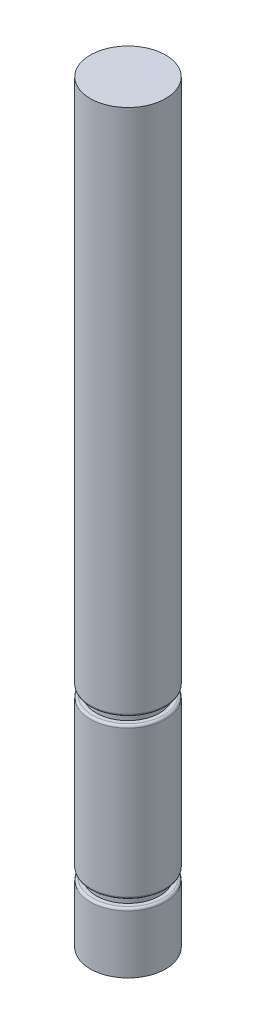
ISO-10303-21;
HEADER;
FILE_DESCRIPTION(('STEP AP214'),'2;1');
FILE_NAME('part.step','',(''),(''),'','','');
FILE_SCHEMA(('AUTOMOTIVE_DESIGN { 1 0 10303 214 1 1 1 1 }'));
ENDSEC;
DATA;
#1=APPLICATION_CONTEXT('core data for automotive mechanical design processes');
#2=APPLICATION_PROTOCOL_DEFINITION('international standard','automotive_design',2000,#1);
#3=PRODUCT_CONTEXT('',#1,'mechanical');
#4=PRODUCT('Part','Part','',(#3));
#5=PRODUCT_RELATED_PRODUCT_CATEGORY('part','',(#4));
#6=PRODUCT_DEFINITION_FORMATION('','',#4);
#7=PRODUCT_DEFINITION_CONTEXT('part definition',#1,'design');
#8=PRODUCT_DEFINITION('design','',#6,#7);
#9=PRODUCT_DEFINITION_SHAPE('','',#8);
#10=(LENGTH_UNIT() NAMED_UNIT(*) SI_UNIT(.MILLI.,.METRE.));
#11=(NAMED_UNIT(*) PLANE_ANGLE_UNIT() SI_UNIT($,.RADIAN.));
#12=(NAMED_UNIT(*) SI_UNIT($,.STERADIAN.) SOLID_ANGLE_UNIT());
#13=UNCERTAINTY_MEASURE_WITH_UNIT(LENGTH_MEASURE(1.E-05),#10,'distance_accuracy_value','');
#14=(GEOMETRIC_REPRESENTATION_CONTEXT(3) GLOBAL_UNCERTAINTY_ASSIGNED_CONTEXT((#13)) GLOBAL_UNIT_ASSIGNED_CONTEXT((#10,
#11,#12)) REPRESENTATION_CONTEXT('',''));
#15=CARTESIAN_POINT('',(0.,0.,0.));
#16=DIRECTION('',(0.,0.,1.));
#17=DIRECTION('',(1.,0.,0.));
#18=AXIS2_PLACEMENT_3D('',#15,#16,#17);
#19=CARTESIAN_POINT('',(0.,100.,0.));
#20=DIRECTION('',(0.,-1.,0.));
#21=DIRECTION('',(0.,0.,-1.));
#22=AXIS2_PLACEMENT_3D('',#19,#20,#21);
#23=CYLINDRICAL_SURFACE('',#22,5.);
#24=CARTESIAN_POINT('',(0.,9.3,0.));
#25=DIRECTION('',(0.,1.,0.));
#26=DIRECTION('',(0.,0.,1.));
#27=AXIS2_PLACEMENT_3D('',#24,#25,#26);
#28=CIRCLE('',#27,5.);
#29=CARTESIAN_POINT('',(0.,9.3,5.));
#30=VERTEX_POINT('',#29);
#31=EDGE_CURVE('E48',#30,#30,#28,.T.);
#32=ORIENTED_EDGE('',*,*,#31,.T.);
#33=EDGE_LOOP('',(#32));
#34=FACE_BOUND('',#33,.T.);
#35=CARTESIAN_POINT('',(0.,28.7,0.));
#36=DIRECTION('',(0.,1.,0.));
#37=DIRECTION('',(0.,0.,1.));
#38=AXIS2_PLACEMENT_3D('',#35,#36,#37);
#39=CIRCLE('',#38,5.);
#40=CARTESIAN_POINT('',(0.,28.7,5.));
#41=VERTEX_POINT('',#40);
#42=EDGE_CURVE('E64',#41,#41,#39,.F.);
#43=ORIENTED_EDGE('',*,*,#42,.T.);
#44=EDGE_LOOP('',(#43));
#45=FACE_BOUND('',#44,.T.);
#46=ADVANCED_FACE('F40',(#34,#45),#23,.T.);
#47=CARTESIAN_POINT('',(0.,29.,0.));
#48=DIRECTION('',(0.,1.,0.));
#49=DIRECTION('',(0.,0.,1.));
#50=AXIS2_PLACEMENT_3D('',#47,#48,#49);
#51=PLANE('',#50);
#52=CARTESIAN_POINT('',(0.,29.,0.));
#53=DIRECTION('',(0.,1.,0.));
#54=DIRECTION('',(0.,0.,1.));
#55=AXIS2_PLACEMENT_3D('',#52,#53,#54);
#56=CIRCLE('',#55,4.7);
#57=CARTESIAN_POINT('',(0.,29.,4.7));
#58=VERTEX_POINT('',#57);
#59=EDGE_CURVE('E68',#58,#58,#56,.T.);
#60=ORIENTED_EDGE('',*,*,#59,.T.);
#61=EDGE_LOOP('',(#60));
#62=FACE_BOUND('',#61,.T.);
#63=CARTESIAN_POINT('',(0.,29.,0.));
#64=DIRECTION('',(0.,1.,0.));
#65=DIRECTION('',(0.,0.,1.));
#66=AXIS2_PLACEMENT_3D('',#63,#64,#65);
#67=CIRCLE('',#66,4.2);
#68=CARTESIAN_POINT('',(0.,29.,4.2));
#69=VERTEX_POINT('',#68);
#70=EDGE_CURVE('E85',#69,#69,#67,.T.);
#71=ORIENTED_EDGE('',*,*,#70,.F.);
#72=EDGE_LOOP('',(#71));
#73=FACE_BOUND('',#72,.T.);
#74=ADVANCED_FACE('F125',(#62,#73),#51,.T.);
#75=CARTESIAN_POINT('',(0.,30.,0.));
#76=DIRECTION('',(0.,1.,0.));
#77=DIRECTION('',(0.,0.,1.));
#78=AXIS2_PLACEMENT_3D('',#75,#76,#77);
#79=PLANE('',#78);
#80=CARTESIAN_POINT('',(0.,30.,0.));
#81=DIRECTION('',(0.,1.,0.));
#82=DIRECTION('',(0.,0.,1.));
#83=AXIS2_PLACEMENT_3D('',#80,#81,#82);
#84=CIRCLE('',#83,4.7);
#85=CARTESIAN_POINT('',(0.,30.,4.7));
#86=VERTEX_POINT('',#85);
#87=EDGE_CURVE('E72',#86,#86,#84,.F.);
#88=ORIENTED_EDGE('',*,*,#87,.T.);
#89=EDGE_LOOP('',(#88));
#90=FACE_BOUND('',#89,.T.);
#91=CARTESIAN_POINT('',(0.,30.,0.));
#92=DIRECTION('',(0.,1.,0.));
#93=DIRECTION('',(0.,0.,1.));
#94=AXIS2_PLACEMENT_3D('',#91,#92,#93);
#95=CIRCLE('',#94,4.2);
#96=CARTESIAN_POINT('',(0.,30.,4.2));
#97=VERTEX_POINT('',#96);
#98=EDGE_CURVE('E89',#97,#97,#95,.T.);
#99=ORIENTED_EDGE('',*,*,#98,.T.);
#100=EDGE_LOOP('',(#99));
#101=FACE_BOUND('',#100,.T.);
#102=ADVANCED_FACE('F134',(#90,#101),#79,.F.);
#103=CARTESIAN_POINT('',(0.,29.,0.));
#104=DIRECTION('',(0.,1.,0.));
#105=DIRECTION('',(0.,0.,1.));
#106=AXIS2_PLACEMENT_3D('',#103,#104,#105);
#107=CYLINDRICAL_SURFACE('',#106,4.2);
#108=ORIENTED_EDGE('',*,*,#70,.T.);
#109=EDGE_LOOP('',(#108));
#110=FACE_BOUND('',#109,.T.);
#111=ORIENTED_EDGE('',*,*,#98,.F.);
#112=EDGE_LOOP('',(#111));
#113=FACE_BOUND('',#112,.T.);
#114=ADVANCED_FACE('F164',(#110,#113),#107,.T.);
#115=CARTESIAN_POINT('',(0.,100.,0.));
#116=DIRECTION('',(0.,1.,0.));
#117=DIRECTION('',(0.,0.,1.));
#118=AXIS2_PLACEMENT_3D('',#115,#116,#117);
#119=PLANE('',#118);
#120=CARTESIAN_POINT('',(0.,100.,0.));
#121=DIRECTION('',(0.,1.,0.));
#122=DIRECTION('',(0.,0.,1.));
#123=AXIS2_PLACEMENT_3D('',#120,#121,#122);
#124=CIRCLE('',#123,5.);
#125=CARTESIAN_POINT('',(0.,100.,5.));
#126=VERTEX_POINT('',#125);
#127=EDGE_CURVE('E80',#126,#126,#124,.T.);
#128=ORIENTED_EDGE('',*,*,#127,.T.);
#129=EDGE_LOOP('',(#128));
#130=FACE_BOUND('',#129,.T.);
#131=ADVANCED_FACE('F142',(#130),#119,.T.);
#132=CARTESIAN_POINT('',(0.,30.3,0.));
#133=DIRECTION('',(0.,1.,0.));
#134=DIRECTION('',(0.,0.,1.));
#135=AXIS2_PLACEMENT_3D('',#132,#133,#134);
#136=CIRCLE('',#135,5.);
#137=CARTESIAN_POINT('',(0.,30.3,5.));
#138=VERTEX_POINT('',#137);
#139=EDGE_CURVE('E76',#138,#138,#136,.T.);
#140=ORIENTED_EDGE('',*,*,#139,.T.);
#141=EDGE_LOOP('',(#140));
#142=FACE_BOUND('',#141,.T.);
#143=ORIENTED_EDGE('',*,*,#127,.F.);
#144=EDGE_LOOP('',(#143));
#145=FACE_BOUND('',#144,.T.);
#146=ADVANCED_FACE('F127',(#142,#145),#23,.T.);
#147=CARTESIAN_POINT('',(0.,30.3,0.));
#148=DIRECTION('',(0.,1.,0.));
#149=DIRECTION('',(0.,0.,1.));
#150=AXIS2_PLACEMENT_3D('',#147,#148,#149);
#151=TOROIDAL_SURFACE('',#150,4.7,0.3);
#152=ORIENTED_EDGE('',*,*,#87,.F.);
#153=EDGE_LOOP('',(#152));
#154=FACE_BOUND('',#153,.T.);
#155=ORIENTED_EDGE('',*,*,#139,.F.);
#156=EDGE_LOOP('',(#155));
#157=FACE_BOUND('',#156,.T.);
#158=ADVANCED_FACE('F141',(#154,#157),#151,.T.);
#159=CARTESIAN_POINT('',(0.,28.7,0.));
#160=DIRECTION('',(0.,1.,0.));
#161=DIRECTION('',(0.,0.,1.));
#162=AXIS2_PLACEMENT_3D('',#159,#160,#161);
#163=TOROIDAL_SURFACE('',#162,4.7,0.3);
#164=ORIENTED_EDGE('',*,*,#42,.F.);
#165=EDGE_LOOP('',(#164));
#166=FACE_BOUND('',#165,.T.);
#167=ORIENTED_EDGE('',*,*,#59,.F.);
#168=EDGE_LOOP('',(#167));
#169=FACE_BOUND('',#168,.T.);
#170=ADVANCED_FACE('F121',(#166,#169),#163,.T.);
#171=CARTESIAN_POINT('',(0.,9.,0.));
#172=DIRECTION('',(0.,1.,0.));
#173=DIRECTION('',(0.,0.,1.));
#174=AXIS2_PLACEMENT_3D('',#171,#172,#173);
#175=PLANE('',#174);
#176=CARTESIAN_POINT('',(0.,9.,0.));
#177=DIRECTION('',(0.,1.,0.));
#178=DIRECTION('',(0.,0.,1.));
#179=AXIS2_PLACEMENT_3D('',#176,#177,#178);
#180=CIRCLE('',#179,4.7);
#181=CARTESIAN_POINT('',(0.,9.,4.7));
#182=VERTEX_POINT('',#181);
#183=EDGE_CURVE('E10',#182,#182,#180,.F.);
#184=ORIENTED_EDGE('',*,*,#183,.T.);
#185=EDGE_LOOP('',(#184));
#186=FACE_BOUND('',#185,.T.);
#187=CARTESIAN_POINT('',(0.,9.,0.));
#188=DIRECTION('',(0.,1.,0.));
#189=DIRECTION('',(0.,0.,1.));
#190=AXIS2_PLACEMENT_3D('',#187,#188,#189);
#191=CIRCLE('',#190,4.2);
#192=CARTESIAN_POINT('',(0.,9.,4.2));
#193=VERTEX_POINT('',#192);
#194=EDGE_CURVE('E93',#193,#193,#191,.T.);
#195=ORIENTED_EDGE('',*,*,#194,.T.);
#196=EDGE_LOOP('',(#195));
#197=FACE_BOUND('',#196,.T.);
#198=ADVANCED_FACE('F105',(#186,#197),#175,.F.);
#199=CARTESIAN_POINT('',(0.,8.,0.));
#200=DIRECTION('',(0.,1.,0.));
#201=DIRECTION('',(0.,0.,1.));
#202=AXIS2_PLACEMENT_3D('',#199,#200,#201);
#203=PLANE('',#202);
#204=CARTESIAN_POINT('',(0.,8.,0.));
#205=DIRECTION('',(0.,1.,0.));
#206=DIRECTION('',(0.,0.,1.));
#207=AXIS2_PLACEMENT_3D('',#204,#205,#206);
#208=CIRCLE('',#207,4.7);
#209=CARTESIAN_POINT('',(0.,8.,4.7));
#210=VERTEX_POINT('',#209);
#211=EDGE_CURVE('E58',#210,#210,#208,.T.);
#212=ORIENTED_EDGE('',*,*,#211,.T.);
#213=EDGE_LOOP('',(#212));
#214=FACE_BOUND('',#213,.T.);
#215=CARTESIAN_POINT('',(0.,8.,0.));
#216=DIRECTION('',(0.,1.,0.));
#217=DIRECTION('',(0.,0.,1.));
#218=AXIS2_PLACEMENT_3D('',#215,#216,#217);
#219=CIRCLE('',#218,4.2);
#220=CARTESIAN_POINT('',(0.,8.,4.2));
#221=VERTEX_POINT('',#220);
#222=EDGE_CURVE('E97',#221,#221,#219,.T.);
#223=ORIENTED_EDGE('',*,*,#222,.F.);
#224=EDGE_LOOP('',(#223));
#225=FACE_BOUND('',#224,.T.);
#226=ADVANCED_FACE('F111',(#214,#225),#203,.T.);
#227=CARTESIAN_POINT('',(0.,9.,0.));
#228=DIRECTION('',(0.,-1.,0.));
#229=DIRECTION('',(0.,0.,-1.));
#230=AXIS2_PLACEMENT_3D('',#227,#228,#229);
#231=CYLINDRICAL_SURFACE('',#230,4.2);
#232=ORIENTED_EDGE('',*,*,#194,.F.);
#233=EDGE_LOOP('',(#232));
#234=FACE_BOUND('',#233,.T.);
#235=ORIENTED_EDGE('',*,*,#222,.T.);
#236=EDGE_LOOP('',(#235));
#237=FACE_BOUND('',#236,.T.);
#238=ADVANCED_FACE('F107',(#234,#237),#231,.T.);
#239=CARTESIAN_POINT('',(0.,0.,0.));
#240=DIRECTION('',(0.,1.,0.));
#241=DIRECTION('',(0.,0.,1.));
#242=AXIS2_PLACEMENT_3D('',#239,#240,#241);
#243=PLANE('',#242);
#244=CARTESIAN_POINT('',(0.,0.,0.));
#245=DIRECTION('',(0.,1.,0.));
#246=DIRECTION('',(0.,0.,1.));
#247=AXIS2_PLACEMENT_3D('',#244,#245,#246);
#248=CIRCLE('',#247,5.);
#249=CARTESIAN_POINT('',(0.,0.,5.));
#250=VERTEX_POINT('',#249);
#251=EDGE_CURVE('E81',#250,#250,#248,.T.);
#252=ORIENTED_EDGE('',*,*,#251,.F.);
#253=EDGE_LOOP('',(#252));
#254=FACE_BOUND('',#253,.T.);
#255=ADVANCED_FACE('F110',(#254),#243,.F.);
#256=CARTESIAN_POINT('',(0.,7.7,0.));
#257=DIRECTION('',(0.,1.,0.));
#258=DIRECTION('',(0.,0.,1.));
#259=AXIS2_PLACEMENT_3D('',#256,#257,#258);
#260=CIRCLE('',#259,5.);
#261=CARTESIAN_POINT('',(0.,7.7,5.));
#262=VERTEX_POINT('',#261);
#263=EDGE_CURVE('E53',#262,#262,#260,.F.);
#264=ORIENTED_EDGE('',*,*,#263,.T.);
#265=EDGE_LOOP('',(#264));
#266=FACE_BOUND('',#265,.T.);
#267=ORIENTED_EDGE('',*,*,#251,.T.);
#268=EDGE_LOOP('',(#267));
#269=FACE_BOUND('',#268,.T.);
#270=ADVANCED_FACE('F128',(#266,#269),#23,.T.);
#271=CARTESIAN_POINT('',(0.,7.7,0.));
#272=DIRECTION('',(0.,1.,0.));
#273=DIRECTION('',(0.,0.,1.));
#274=AXIS2_PLACEMENT_3D('',#271,#272,#273);
#275=TOROIDAL_SURFACE('',#274,4.7,0.3);
#276=ORIENTED_EDGE('',*,*,#263,.F.);
#277=EDGE_LOOP('',(#276));
#278=FACE_BOUND('',#277,.T.);
#279=ORIENTED_EDGE('',*,*,#211,.F.);
#280=EDGE_LOOP('',(#279));
#281=FACE_BOUND('',#280,.T.);
#282=ADVANCED_FACE('F145',(#278,#281),#275,.T.);
#283=CARTESIAN_POINT('',(0.,9.3,0.));
#284=DIRECTION('',(0.,1.,0.));
#285=DIRECTION('',(0.,0.,1.));
#286=AXIS2_PLACEMENT_3D('',#283,#284,#285);
#287=TOROIDAL_SURFACE('',#286,4.7,0.3);
#288=ORIENTED_EDGE('',*,*,#183,.F.);
#289=EDGE_LOOP('',(#288));
#290=FACE_BOUND('',#289,.T.);
#291=ORIENTED_EDGE('',*,*,#31,.F.);
#292=EDGE_LOOP('',(#291));
#293=FACE_BOUND('',#292,.T.);
#294=ADVANCED_FACE('F42',(#290,#293),#287,.T.);
#295=CLOSED_SHELL('',(#46,#74,#102,#114,#131,#146,#158,#170,#198,#226,#238,#255,#270,#282,#294));
#296=MANIFOLD_SOLID_BREP('B2',#295);
#297=ADVANCED_BREP_SHAPE_REPRESENTATION('',(#18,#296),#14);
#298=SHAPE_DEFINITION_REPRESENTATION(#9,#297);
ENDSEC;
END-ISO-10303-21;
